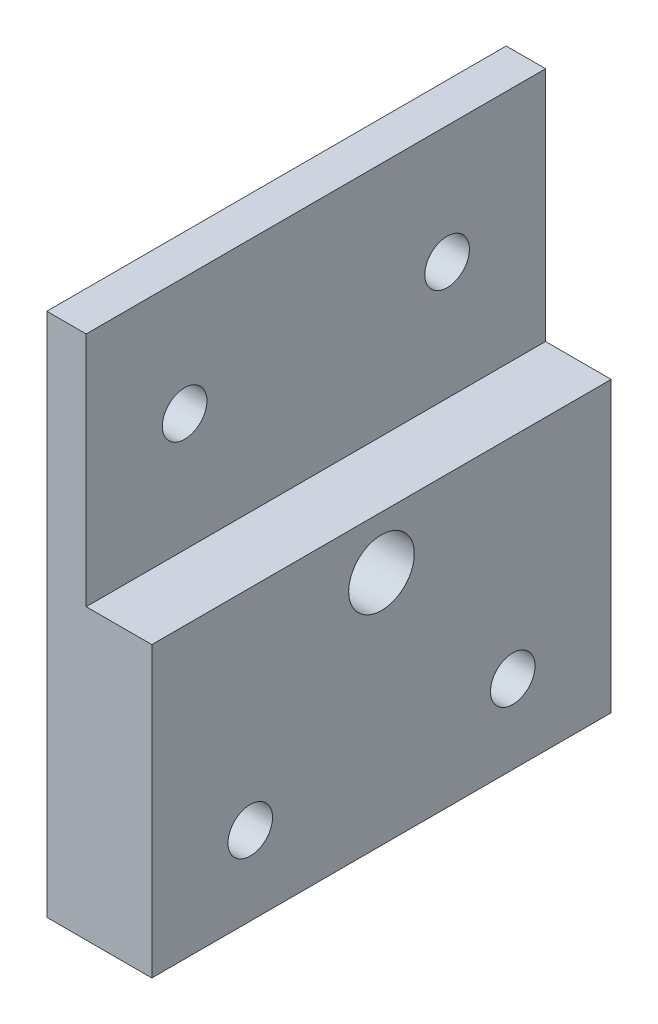
ISO-10303-21;
HEADER;
FILE_DESCRIPTION(('STEP AP214'),'2;1');
FILE_NAME('part.step','',(''),(''),'','','');
FILE_SCHEMA(('AUTOMOTIVE_DESIGN { 1 0 10303 214 1 1 1 1 }'));
ENDSEC;
DATA;
#1=APPLICATION_CONTEXT('core data for automotive mechanical design processes');
#2=APPLICATION_PROTOCOL_DEFINITION('international standard','automotive_design',2000,#1);
#3=PRODUCT_CONTEXT('',#1,'mechanical');
#4=PRODUCT('Part','Part','',(#3));
#5=PRODUCT_RELATED_PRODUCT_CATEGORY('part','',(#4));
#6=PRODUCT_DEFINITION_FORMATION('','',#4);
#7=PRODUCT_DEFINITION_CONTEXT('part definition',#1,'design');
#8=PRODUCT_DEFINITION('design','',#6,#7);
#9=PRODUCT_DEFINITION_SHAPE('','',#8);
#10=(LENGTH_UNIT() NAMED_UNIT(*) SI_UNIT(.MILLI.,.METRE.));
#11=(NAMED_UNIT(*) PLANE_ANGLE_UNIT() SI_UNIT($,.RADIAN.));
#12=(NAMED_UNIT(*) SI_UNIT($,.STERADIAN.) SOLID_ANGLE_UNIT());
#13=UNCERTAINTY_MEASURE_WITH_UNIT(LENGTH_MEASURE(1.E-05),#10,'distance_accuracy_value','');
#14=(GEOMETRIC_REPRESENTATION_CONTEXT(3) GLOBAL_UNCERTAINTY_ASSIGNED_CONTEXT((#13)) GLOBAL_UNIT_ASSIGNED_CONTEXT((#10,
#11,#12)) REPRESENTATION_CONTEXT('',''));
#15=CARTESIAN_POINT('',(0.,0.,0.));
#16=DIRECTION('',(0.,0.,1.));
#17=DIRECTION('',(1.,0.,0.));
#18=AXIS2_PLACEMENT_3D('',#15,#16,#17);
#19=CARTESIAN_POINT('',(0.,9.,-35.));
#20=DIRECTION('',(1.,0.,0.));
#21=DIRECTION('',(0.,1.,0.));
#22=AXIS2_PLACEMENT_3D('',#19,#20,#21);
#23=PLANE('',#22);
#24=CARTESIAN_POINT('',(0.,0.,-7.50000000000018));
#25=DIRECTION('',(1.,0.,0.));
#26=DIRECTION('',(0.,1.,0.));
#27=AXIS2_PLACEMENT_3D('',#24,#25,#26);
#28=CIRCLE('',#27,1.69999999999999);
#29=CARTESIAN_POINT('',(0.,1.69999999999997,-7.50000000000018));
#30=VERTEX_POINT('',#29);
#31=EDGE_CURVE('E240',#30,#30,#28,.T.);
#32=ORIENTED_EDGE('',*,*,#31,.F.);
#33=EDGE_LOOP('',(#32));
#34=FACE_BOUND('',#33,.T.);
#35=CARTESIAN_POINT('',(0.,0.,-27.5));
#36=DIRECTION('',(1.,0.,0.));
#37=DIRECTION('',(0.,1.,0.));
#38=AXIS2_PLACEMENT_3D('',#35,#36,#37);
#39=CIRCLE('',#38,1.69999999999999);
#40=CARTESIAN_POINT('',(0.,1.69999999999998,-27.5));
#41=VERTEX_POINT('',#40);
#42=EDGE_CURVE('E121',#41,#41,#39,.T.);
#43=ORIENTED_EDGE('',*,*,#42,.F.);
#44=EDGE_LOOP('',(#43));
#45=FACE_BOUND('',#44,.T.);
#46=DIRECTION('',(0.,1.,0.));
#47=VECTOR('',#46,1.);
#48=CARTESIAN_POINT('',(0.,9.,0.));
#49=LINE('',#48,#47);
#50=CARTESIAN_POINT('',(0.,-9.,0.));
#51=VERTEX_POINT('',#50);
#52=CARTESIAN_POINT('',(0.,9.,0.));
#53=VERTEX_POINT('',#52);
#54=EDGE_CURVE('E117',#51,#53,#49,.T.);
#55=ORIENTED_EDGE('',*,*,#54,.F.);
#56=DIRECTION('',(0.,0.,1.));
#57=VECTOR('',#56,1.);
#58=CARTESIAN_POINT('',(0.,-9.,-35.));
#59=LINE('',#58,#57);
#60=CARTESIAN_POINT('',(0.,-9.,-35.));
#61=VERTEX_POINT('',#60);
#62=EDGE_CURVE('E11',#61,#51,#59,.T.);
#63=ORIENTED_EDGE('',*,*,#62,.F.);
#64=DIRECTION('',(0.,1.,0.));
#65=VECTOR('',#64,1.);
#66=CARTESIAN_POINT('',(0.,9.,-35.));
#67=LINE('',#66,#65);
#68=CARTESIAN_POINT('',(0.,9.,-35.));
#69=VERTEX_POINT('',#68);
#70=EDGE_CURVE('E132',#61,#69,#67,.T.);
#71=ORIENTED_EDGE('',*,*,#70,.T.);
#72=DIRECTION('',(0.,0.,1.));
#73=VECTOR('',#72,1.);
#74=CARTESIAN_POINT('',(0.,9.,-35.));
#75=LINE('',#74,#73);
#76=EDGE_CURVE('E37',#69,#53,#75,.T.);
#77=ORIENTED_EDGE('',*,*,#76,.T.);
#78=EDGE_LOOP('',(#55,#63,#71,#77));
#79=FACE_BOUND('',#78,.T.);
#80=ADVANCED_FACE('F34',(#34,#45,#79),#23,.T.);
#81=CARTESIAN_POINT('',(0.,-9.,-35.));
#82=DIRECTION('',(0.,1.,0.));
#83=DIRECTION('',(0.,0.,1.));
#84=AXIS2_PLACEMENT_3D('',#81,#82,#83);
#85=PLANE('',#84);
#86=DIRECTION('',(-1.,0.,0.));
#87=VECTOR('',#86,1.);
#88=CARTESIAN_POINT('',(0.,-9.,0.));
#89=LINE('',#88,#87);
#90=CARTESIAN_POINT('',(5.,-9.,0.));
#91=VERTEX_POINT('',#90);
#92=EDGE_CURVE('E130',#91,#51,#89,.T.);
#93=ORIENTED_EDGE('',*,*,#92,.F.);
#94=DIRECTION('',(0.,0.,1.));
#95=VECTOR('',#94,1.);
#96=CARTESIAN_POINT('',(5.,-9.,-35.));
#97=LINE('',#96,#95);
#98=CARTESIAN_POINT('',(5.,-9.,-35.));
#99=VERTEX_POINT('',#98);
#100=EDGE_CURVE('E43',#99,#91,#97,.T.);
#101=ORIENTED_EDGE('',*,*,#100,.F.);
#102=DIRECTION('',(-1.,0.,0.));
#103=VECTOR('',#102,1.);
#104=CARTESIAN_POINT('',(0.,-9.,-35.));
#105=LINE('',#104,#103);
#106=EDGE_CURVE('E112',#99,#61,#105,.T.);
#107=ORIENTED_EDGE('',*,*,#106,.T.);
#108=ORIENTED_EDGE('',*,*,#62,.T.);
#109=EDGE_LOOP('',(#93,#101,#107,#108));
#110=FACE_BOUND('',#109,.T.);
#111=ADVANCED_FACE('F140',(#110),#85,.T.);
#112=CARTESIAN_POINT('',(5.,-9.,-35.));
#113=DIRECTION('',(1.,0.,0.));
#114=DIRECTION('',(0.,1.,0.));
#115=AXIS2_PLACEMENT_3D('',#112,#113,#114);
#116=PLANE('',#115);
#117=CARTESIAN_POINT('',(5.00000000000001,-13.,-17.5));
#118=DIRECTION('',(-1.,0.,0.));
#119=DIRECTION('',(0.,0.,1.));
#120=AXIS2_PLACEMENT_3D('',#117,#118,#119);
#121=CIRCLE('',#120,2.5);
#122=CARTESIAN_POINT('',(5.00000000000001,-13.,-15.));
#123=VERTEX_POINT('',#122);
#124=EDGE_CURVE('E206',#123,#123,#121,.T.);
#125=ORIENTED_EDGE('',*,*,#124,.T.);
#126=EDGE_LOOP('',(#125));
#127=FACE_BOUND('',#126,.T.);
#128=CARTESIAN_POINT('',(5.00000000000001,-24.9999999999999,-7.5));
#129=DIRECTION('',(-1.,0.,0.));
#130=DIRECTION('',(0.,0.,1.));
#131=AXIS2_PLACEMENT_3D('',#128,#129,#130);
#132=CIRCLE('',#131,1.7);
#133=CARTESIAN_POINT('',(5.00000000000001,-24.9999999999999,-5.8));
#134=VERTEX_POINT('',#133);
#135=EDGE_CURVE('E222',#134,#134,#132,.T.);
#136=ORIENTED_EDGE('',*,*,#135,.T.);
#137=EDGE_LOOP('',(#136));
#138=FACE_BOUND('',#137,.T.);
#139=CARTESIAN_POINT('',(5.00000000000001,-25.,-27.5));
#140=DIRECTION('',(-1.,0.,0.));
#141=DIRECTION('',(0.,0.,1.));
#142=AXIS2_PLACEMENT_3D('',#139,#140,#141);
#143=CIRCLE('',#142,1.7);
#144=CARTESIAN_POINT('',(5.00000000000001,-25.,-25.8));
#145=VERTEX_POINT('',#144);
#146=EDGE_CURVE('E234',#145,#145,#143,.T.);
#147=ORIENTED_EDGE('',*,*,#146,.T.);
#148=EDGE_LOOP('',(#147));
#149=FACE_BOUND('',#148,.T.);
#150=DIRECTION('',(0.,1.,0.));
#151=VECTOR('',#150,1.);
#152=CARTESIAN_POINT('',(5.,-9.,0.));
#153=LINE('',#152,#151);
#154=CARTESIAN_POINT('',(5.,-31.,0.));
#155=VERTEX_POINT('',#154);
#156=EDGE_CURVE('E108',#155,#91,#153,.T.);
#157=ORIENTED_EDGE('',*,*,#156,.F.);
#158=DIRECTION('',(0.,0.,1.));
#159=VECTOR('',#158,1.);
#160=CARTESIAN_POINT('',(5.,-31.,-35.));
#161=LINE('',#160,#159);
#162=CARTESIAN_POINT('',(5.,-31.,-35.));
#163=VERTEX_POINT('',#162);
#164=EDGE_CURVE('E96',#163,#155,#161,.T.);
#165=ORIENTED_EDGE('',*,*,#164,.F.);
#166=DIRECTION('',(0.,1.,0.));
#167=VECTOR('',#166,1.);
#168=CARTESIAN_POINT('',(5.,-9.,-35.));
#169=LINE('',#168,#167);
#170=EDGE_CURVE('E103',#163,#99,#169,.T.);
#171=ORIENTED_EDGE('',*,*,#170,.T.);
#172=ORIENTED_EDGE('',*,*,#100,.T.);
#173=EDGE_LOOP('',(#157,#165,#171,#172));
#174=FACE_BOUND('',#173,.T.);
#175=ADVANCED_FACE('F106',(#127,#138,#149,#174),#116,.T.);
#176=CARTESIAN_POINT('',(0.,-31.,-35.));
#177=DIRECTION('',(0.,-1.,0.));
#178=DIRECTION('',(0.,0.,-1.));
#179=AXIS2_PLACEMENT_3D('',#176,#177,#178);
#180=PLANE('',#179);
#181=DIRECTION('',(1.,0.,0.));
#182=VECTOR('',#181,1.);
#183=CARTESIAN_POINT('',(0.,-31.,0.));
#184=LINE('',#183,#182);
#185=CARTESIAN_POINT('',(-3.,-31.,0.));
#186=VERTEX_POINT('',#185);
#187=EDGE_CURVE('E127',#186,#155,#184,.T.);
#188=ORIENTED_EDGE('',*,*,#187,.F.);
#189=DIRECTION('',(0.,0.,1.));
#190=VECTOR('',#189,1.);
#191=CARTESIAN_POINT('',(-3.,-31.,-35.));
#192=LINE('',#191,#190);
#193=CARTESIAN_POINT('',(-3.,-31.,-35.));
#194=VERTEX_POINT('',#193);
#195=EDGE_CURVE('E98',#194,#186,#192,.T.);
#196=ORIENTED_EDGE('',*,*,#195,.F.);
#197=DIRECTION('',(1.,0.,0.));
#198=VECTOR('',#197,1.);
#199=CARTESIAN_POINT('',(0.,-31.,-35.));
#200=LINE('',#199,#198);
#201=EDGE_CURVE('E93',#194,#163,#200,.T.);
#202=ORIENTED_EDGE('',*,*,#201,.T.);
#203=ORIENTED_EDGE('',*,*,#164,.T.);
#204=EDGE_LOOP('',(#188,#196,#202,#203));
#205=FACE_BOUND('',#204,.T.);
#206=ADVANCED_FACE('F95',(#205),#180,.T.);
#207=CARTESIAN_POINT('',(-3.,9.,-35.));
#208=DIRECTION('',(-1.,0.,0.));
#209=DIRECTION('',(0.,-1.,0.));
#210=AXIS2_PLACEMENT_3D('',#207,#208,#209);
#211=PLANE('',#210);
#212=CARTESIAN_POINT('',(-3.,-13.,-17.5));
#213=DIRECTION('',(-1.,0.,0.));
#214=DIRECTION('',(0.,0.,1.));
#215=AXIS2_PLACEMENT_3D('',#212,#213,#214);
#216=CIRCLE('',#215,2.5);
#217=CARTESIAN_POINT('',(-3.,-13.,-15.));
#218=VERTEX_POINT('',#217);
#219=EDGE_CURVE('E209',#218,#218,#216,.T.);
#220=ORIENTED_EDGE('',*,*,#219,.F.);
#221=EDGE_LOOP('',(#220));
#222=FACE_BOUND('',#221,.T.);
#223=CARTESIAN_POINT('',(-3.,-24.9999999999999,-7.5));
#224=DIRECTION('',(-1.,0.,0.));
#225=DIRECTION('',(0.,0.,1.));
#226=AXIS2_PLACEMENT_3D('',#223,#224,#225);
#227=CIRCLE('',#226,3.25);
#228=CARTESIAN_POINT('',(-3.,-24.9999999999999,-4.25));
#229=VERTEX_POINT('',#228);
#230=EDGE_CURVE('E211',#229,#229,#227,.T.);
#231=ORIENTED_EDGE('',*,*,#230,.F.);
#232=EDGE_LOOP('',(#231));
#233=FACE_BOUND('',#232,.T.);
#234=CARTESIAN_POINT('',(-3.,-25.,-27.5));
#235=DIRECTION('',(-1.,0.,0.));
#236=DIRECTION('',(0.,0.,1.));
#237=AXIS2_PLACEMENT_3D('',#234,#235,#236);
#238=CIRCLE('',#237,3.25);
#239=CARTESIAN_POINT('',(-3.,-25.,-24.25));
#240=VERTEX_POINT('',#239);
#241=EDGE_CURVE('E225',#240,#240,#238,.T.);
#242=ORIENTED_EDGE('',*,*,#241,.F.);
#243=EDGE_LOOP('',(#242));
#244=FACE_BOUND('',#243,.T.);
#245=CARTESIAN_POINT('',(-3.,0.,-7.50000000000018));
#246=DIRECTION('',(-1.,0.,0.));
#247=DIRECTION('',(0.,0.,1.));
#248=AXIS2_PLACEMENT_3D('',#245,#246,#247);
#249=CIRCLE('',#248,1.69999999999999);
#250=CARTESIAN_POINT('',(-3.,0.,-5.80000000000019));
#251=VERTEX_POINT('',#250);
#252=EDGE_CURVE('E237',#251,#251,#249,.T.);
#253=ORIENTED_EDGE('',*,*,#252,.F.);
#254=EDGE_LOOP('',(#253));
#255=FACE_BOUND('',#254,.T.);
#256=CARTESIAN_POINT('',(-3.,0.,-27.5));
#257=DIRECTION('',(-1.,0.,0.));
#258=DIRECTION('',(0.,0.,1.));
#259=AXIS2_PLACEMENT_3D('',#256,#257,#258);
#260=CIRCLE('',#259,1.69999999999999);
#261=CARTESIAN_POINT('',(-3.,0.,-25.8));
#262=VERTEX_POINT('',#261);
#263=EDGE_CURVE('E243',#262,#262,#260,.T.);
#264=ORIENTED_EDGE('',*,*,#263,.F.);
#265=EDGE_LOOP('',(#264));
#266=FACE_BOUND('',#265,.T.);
#267=DIRECTION('',(0.,-1.,0.));
#268=VECTOR('',#267,1.);
#269=CARTESIAN_POINT('',(-3.,9.,0.));
#270=LINE('',#269,#268);
#271=CARTESIAN_POINT('',(-3.,9.,0.));
#272=VERTEX_POINT('',#271);
#273=EDGE_CURVE('E124',#272,#186,#270,.T.);
#274=ORIENTED_EDGE('',*,*,#273,.F.);
#275=DIRECTION('',(0.,0.,1.));
#276=VECTOR('',#275,1.);
#277=CARTESIAN_POINT('',(-3.,9.,-35.));
#278=LINE('',#277,#276);
#279=CARTESIAN_POINT('',(-3.,9.,-35.));
#280=VERTEX_POINT('',#279);
#281=EDGE_CURVE('E135',#280,#272,#278,.T.);
#282=ORIENTED_EDGE('',*,*,#281,.F.);
#283=DIRECTION('',(0.,-1.,0.));
#284=VECTOR('',#283,1.);
#285=CARTESIAN_POINT('',(-3.,9.,-35.));
#286=LINE('',#285,#284);
#287=EDGE_CURVE('E104',#280,#194,#286,.T.);
#288=ORIENTED_EDGE('',*,*,#287,.T.);
#289=ORIENTED_EDGE('',*,*,#195,.T.);
#290=EDGE_LOOP('',(#274,#282,#288,#289));
#291=FACE_BOUND('',#290,.T.);
#292=ADVANCED_FACE('F155',(#222,#233,#244,#255,#266,#291),#211,.T.);
#293=CARTESIAN_POINT('',(0.,9.,-35.));
#294=DIRECTION('',(0.,1.,0.));
#295=DIRECTION('',(0.,0.,1.));
#296=AXIS2_PLACEMENT_3D('',#293,#294,#295);
#297=PLANE('',#296);
#298=DIRECTION('',(-1.,0.,0.));
#299=VECTOR('',#298,1.);
#300=CARTESIAN_POINT('',(0.,9.,0.));
#301=LINE('',#300,#299);
#302=EDGE_CURVE('E120',#53,#272,#301,.T.);
#303=ORIENTED_EDGE('',*,*,#302,.F.);
#304=ORIENTED_EDGE('',*,*,#76,.F.);
#305=DIRECTION('',(-1.,0.,0.));
#306=VECTOR('',#305,1.);
#307=CARTESIAN_POINT('',(0.,9.,-35.));
#308=LINE('',#307,#306);
#309=EDGE_CURVE('E249',#69,#280,#308,.T.);
#310=ORIENTED_EDGE('',*,*,#309,.T.);
#311=ORIENTED_EDGE('',*,*,#281,.T.);
#312=EDGE_LOOP('',(#303,#304,#310,#311));
#313=FACE_BOUND('',#312,.T.);
#314=ADVANCED_FACE('F137',(#313),#297,.T.);
#315=CARTESIAN_POINT('',(0.,0.,-35.));
#316=DIRECTION('',(0.,0.,1.));
#317=DIRECTION('',(1.,0.,0.));
#318=AXIS2_PLACEMENT_3D('',#315,#316,#317);
#319=PLANE('',#318);
#320=ORIENTED_EDGE('',*,*,#70,.F.);
#321=ORIENTED_EDGE('',*,*,#106,.F.);
#322=ORIENTED_EDGE('',*,*,#170,.F.);
#323=ORIENTED_EDGE('',*,*,#201,.F.);
#324=ORIENTED_EDGE('',*,*,#287,.F.);
#325=ORIENTED_EDGE('',*,*,#309,.F.);
#326=EDGE_LOOP('',(#320,#321,#322,#323,#324,#325));
#327=FACE_BOUND('',#326,.T.);
#328=ADVANCED_FACE('F111',(#327),#319,.F.);
#329=CARTESIAN_POINT('',(0.,0.,0.));
#330=DIRECTION('',(0.,0.,1.));
#331=DIRECTION('',(1.,0.,0.));
#332=AXIS2_PLACEMENT_3D('',#329,#330,#331);
#333=PLANE('',#332);
#334=ORIENTED_EDGE('',*,*,#54,.T.);
#335=ORIENTED_EDGE('',*,*,#302,.T.);
#336=ORIENTED_EDGE('',*,*,#273,.T.);
#337=ORIENTED_EDGE('',*,*,#187,.T.);
#338=ORIENTED_EDGE('',*,*,#156,.T.);
#339=ORIENTED_EDGE('',*,*,#92,.T.);
#340=EDGE_LOOP('',(#334,#335,#336,#337,#338,#339));
#341=FACE_BOUND('',#340,.T.);
#342=ADVANCED_FACE('F139',(#341),#333,.T.);
#343=CARTESIAN_POINT('',(-3.,0.,-27.5));
#344=DIRECTION('',(-1.,0.,0.));
#345=DIRECTION('',(0.,0.,1.));
#346=AXIS2_PLACEMENT_3D('',#343,#344,#345);
#347=CYLINDRICAL_SURFACE('',#346,1.69999999999999);
#348=ORIENTED_EDGE('',*,*,#42,.T.);
#349=EDGE_LOOP('',(#348));
#350=FACE_BOUND('',#349,.T.);
#351=ORIENTED_EDGE('',*,*,#263,.T.);
#352=EDGE_LOOP('',(#351));
#353=FACE_BOUND('',#352,.T.);
#354=ADVANCED_FACE('F165',(#350,#353),#347,.F.);
#355=CARTESIAN_POINT('',(-3.,0.,-7.50000000000018));
#356=DIRECTION('',(-1.,0.,0.));
#357=DIRECTION('',(0.,0.,1.));
#358=AXIS2_PLACEMENT_3D('',#355,#356,#357);
#359=CYLINDRICAL_SURFACE('',#358,1.69999999999999);
#360=ORIENTED_EDGE('',*,*,#31,.T.);
#361=EDGE_LOOP('',(#360));
#362=FACE_BOUND('',#361,.T.);
#363=ORIENTED_EDGE('',*,*,#252,.T.);
#364=EDGE_LOOP('',(#363));
#365=FACE_BOUND('',#364,.T.);
#366=ADVANCED_FACE('F169',(#362,#365),#359,.F.);
#367=CARTESIAN_POINT('',(-3.,-25.,-27.5));
#368=DIRECTION('',(-1.,0.,0.));
#369=DIRECTION('',(0.,0.,1.));
#370=AXIS2_PLACEMENT_3D('',#367,#368,#369);
#371=CYLINDRICAL_SURFACE('',#370,1.7);
#372=ORIENTED_EDGE('',*,*,#146,.F.);
#373=EDGE_LOOP('',(#372));
#374=FACE_BOUND('',#373,.T.);
#375=CARTESIAN_POINT('',(0.,-25.,-27.5));
#376=DIRECTION('',(-1.,0.,0.));
#377=DIRECTION('',(0.,0.,1.));
#378=AXIS2_PLACEMENT_3D('',#375,#376,#377);
#379=CIRCLE('',#378,1.7);
#380=CARTESIAN_POINT('',(0.,-25.,-25.8));
#381=VERTEX_POINT('',#380);
#382=EDGE_CURVE('E231',#381,#381,#379,.T.);
#383=ORIENTED_EDGE('',*,*,#382,.T.);
#384=EDGE_LOOP('',(#383));
#385=FACE_BOUND('',#384,.T.);
#386=ADVANCED_FACE('F173',(#374,#385),#371,.F.);
#387=CARTESIAN_POINT('',(0.,-23.3,-27.5));
#388=DIRECTION('',(1.,0.,0.));
#389=DIRECTION('',(0.,0.,-1.));
#390=AXIS2_PLACEMENT_3D('',#387,#388,#389);
#391=PLANE('',#390);
#392=ORIENTED_EDGE('',*,*,#382,.F.);
#393=EDGE_LOOP('',(#392));
#394=FACE_BOUND('',#393,.T.);
#395=CARTESIAN_POINT('',(0.,-25.,-27.5));
#396=DIRECTION('',(-1.,0.,0.));
#397=DIRECTION('',(0.,0.,1.));
#398=AXIS2_PLACEMENT_3D('',#395,#396,#397);
#399=CIRCLE('',#398,3.25);
#400=CARTESIAN_POINT('',(0.,-25.,-24.25));
#401=VERTEX_POINT('',#400);
#402=EDGE_CURVE('E228',#401,#401,#399,.T.);
#403=ORIENTED_EDGE('',*,*,#402,.T.);
#404=EDGE_LOOP('',(#403));
#405=FACE_BOUND('',#404,.T.);
#406=ADVANCED_FACE('F177',(#394,#405),#391,.F.);
#407=CARTESIAN_POINT('',(-3.,-25.,-27.5));
#408=DIRECTION('',(-1.,0.,0.));
#409=DIRECTION('',(0.,0.,1.));
#410=AXIS2_PLACEMENT_3D('',#407,#408,#409);
#411=CYLINDRICAL_SURFACE('',#410,3.25);
#412=ORIENTED_EDGE('',*,*,#402,.F.);
#413=EDGE_LOOP('',(#412));
#414=FACE_BOUND('',#413,.T.);
#415=ORIENTED_EDGE('',*,*,#241,.T.);
#416=EDGE_LOOP('',(#415));
#417=FACE_BOUND('',#416,.T.);
#418=ADVANCED_FACE('F181',(#414,#417),#411,.F.);
#419=CARTESIAN_POINT('',(-3.,-24.9999999999999,-7.5));
#420=DIRECTION('',(-1.,0.,0.));
#421=DIRECTION('',(0.,0.,1.));
#422=AXIS2_PLACEMENT_3D('',#419,#420,#421);
#423=CYLINDRICAL_SURFACE('',#422,1.7);
#424=ORIENTED_EDGE('',*,*,#135,.F.);
#425=EDGE_LOOP('',(#424));
#426=FACE_BOUND('',#425,.T.);
#427=CARTESIAN_POINT('',(0.,-24.9999999999999,-7.5));
#428=DIRECTION('',(-1.,0.,0.));
#429=DIRECTION('',(0.,0.,1.));
#430=AXIS2_PLACEMENT_3D('',#427,#428,#429);
#431=CIRCLE('',#430,1.7);
#432=CARTESIAN_POINT('',(0.,-24.9999999999999,-5.8));
#433=VERTEX_POINT('',#432);
#434=EDGE_CURVE('E219',#433,#433,#431,.T.);
#435=ORIENTED_EDGE('',*,*,#434,.T.);
#436=EDGE_LOOP('',(#435));
#437=FACE_BOUND('',#436,.T.);
#438=ADVANCED_FACE('F185',(#426,#437),#423,.F.);
#439=CARTESIAN_POINT('',(0.,-23.2999999999999,-7.5));
#440=DIRECTION('',(1.,0.,0.));
#441=DIRECTION('',(0.,0.,-1.));
#442=AXIS2_PLACEMENT_3D('',#439,#440,#441);
#443=PLANE('',#442);
#444=ORIENTED_EDGE('',*,*,#434,.F.);
#445=EDGE_LOOP('',(#444));
#446=FACE_BOUND('',#445,.T.);
#447=CARTESIAN_POINT('',(0.,-24.9999999999999,-7.5));
#448=DIRECTION('',(-1.,0.,0.));
#449=DIRECTION('',(0.,0.,1.));
#450=AXIS2_PLACEMENT_3D('',#447,#448,#449);
#451=CIRCLE('',#450,3.25);
#452=CARTESIAN_POINT('',(0.,-24.9999999999999,-4.25));
#453=VERTEX_POINT('',#452);
#454=EDGE_CURVE('E216',#453,#453,#451,.T.);
#455=ORIENTED_EDGE('',*,*,#454,.T.);
#456=EDGE_LOOP('',(#455));
#457=FACE_BOUND('',#456,.T.);
#458=ADVANCED_FACE('F189',(#446,#457),#443,.F.);
#459=CARTESIAN_POINT('',(-3.,-24.9999999999999,-7.5));
#460=DIRECTION('',(-1.,0.,0.));
#461=DIRECTION('',(0.,0.,1.));
#462=AXIS2_PLACEMENT_3D('',#459,#460,#461);
#463=CYLINDRICAL_SURFACE('',#462,3.25);
#464=ORIENTED_EDGE('',*,*,#454,.F.);
#465=EDGE_LOOP('',(#464));
#466=FACE_BOUND('',#465,.T.);
#467=ORIENTED_EDGE('',*,*,#230,.T.);
#468=EDGE_LOOP('',(#467));
#469=FACE_BOUND('',#468,.T.);
#470=ADVANCED_FACE('F193',(#466,#469),#463,.F.);
#471=CARTESIAN_POINT('',(-3.,-13.,-17.5));
#472=DIRECTION('',(-1.,0.,0.));
#473=DIRECTION('',(0.,0.,1.));
#474=AXIS2_PLACEMENT_3D('',#471,#472,#473);
#475=CYLINDRICAL_SURFACE('',#474,2.5);
#476=ORIENTED_EDGE('',*,*,#124,.F.);
#477=EDGE_LOOP('',(#476));
#478=FACE_BOUND('',#477,.T.);
#479=ORIENTED_EDGE('',*,*,#219,.T.);
#480=EDGE_LOOP('',(#479));
#481=FACE_BOUND('',#480,.T.);
#482=ADVANCED_FACE('F197',(#478,#481),#475,.F.);
#483=CLOSED_SHELL('',(#80,#111,#175,#206,#292,#314,#328,#342,#354,#366,#386,#406,#418,#438,#458,
#470,#482));
#484=MANIFOLD_SOLID_BREP('B2',#483);
#485=ADVANCED_BREP_SHAPE_REPRESENTATION('',(#18,#484),#14);
#486=SHAPE_DEFINITION_REPRESENTATION(#9,#485);
ENDSEC;
END-ISO-10303-21;
